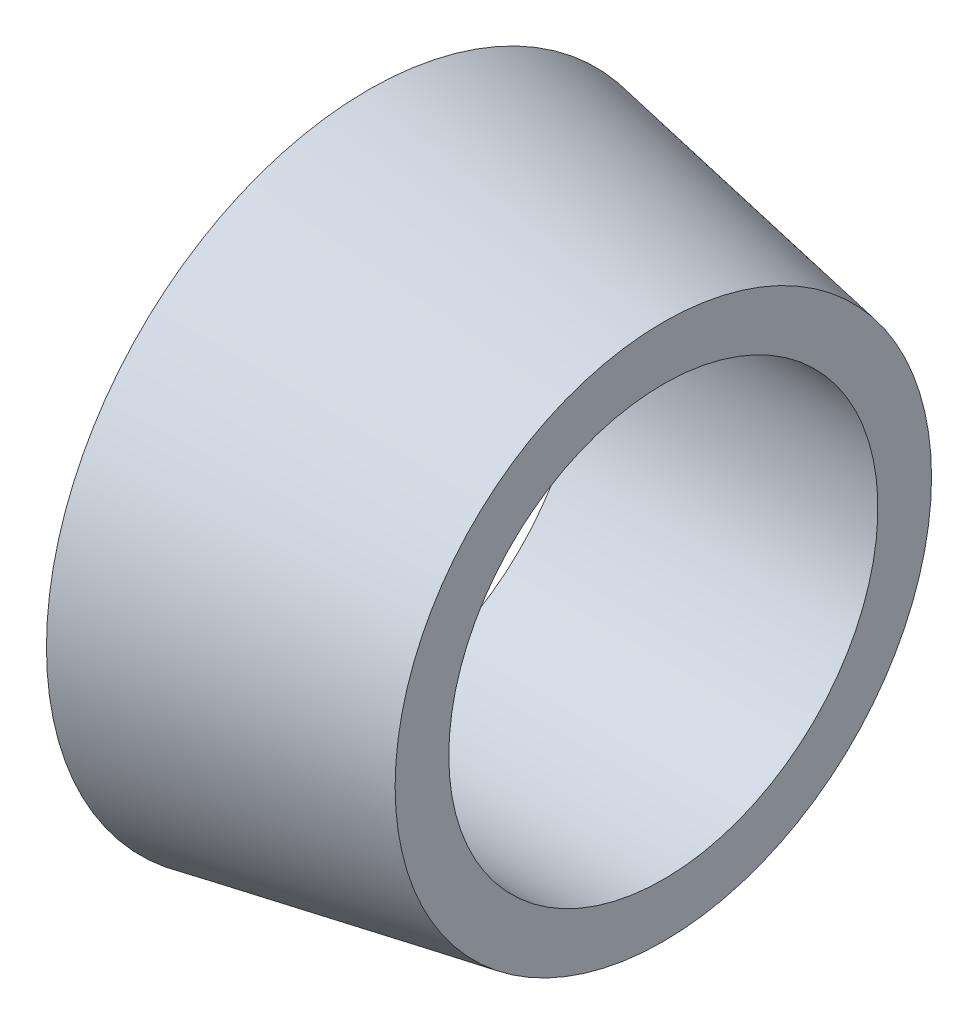
ISO-10303-21;
HEADER;
FILE_DESCRIPTION(('STEP AP214'),'2;1');
FILE_NAME('part.step','',(''),(''),'','','');
FILE_SCHEMA(('AUTOMOTIVE_DESIGN { 1 0 10303 214 1 1 1 1 }'));
ENDSEC;
DATA;
#1=APPLICATION_CONTEXT('core data for automotive mechanical design processes');
#2=APPLICATION_PROTOCOL_DEFINITION('international standard','automotive_design',2000,#1);
#3=PRODUCT_CONTEXT('',#1,'mechanical');
#4=PRODUCT('Part','Part','',(#3));
#5=PRODUCT_RELATED_PRODUCT_CATEGORY('part','',(#4));
#6=PRODUCT_DEFINITION_FORMATION('','',#4);
#7=PRODUCT_DEFINITION_CONTEXT('part definition',#1,'design');
#8=PRODUCT_DEFINITION('design','',#6,#7);
#9=PRODUCT_DEFINITION_SHAPE('','',#8);
#10=(LENGTH_UNIT() NAMED_UNIT(*) SI_UNIT(.MILLI.,.METRE.));
#11=(NAMED_UNIT(*) PLANE_ANGLE_UNIT() SI_UNIT($,.RADIAN.));
#12=(NAMED_UNIT(*) SI_UNIT($,.STERADIAN.) SOLID_ANGLE_UNIT());
#13=UNCERTAINTY_MEASURE_WITH_UNIT(LENGTH_MEASURE(1.E-05),#10,'distance_accuracy_value','');
#14=(GEOMETRIC_REPRESENTATION_CONTEXT(3) GLOBAL_UNCERTAINTY_ASSIGNED_CONTEXT((#13)) GLOBAL_UNIT_ASSIGNED_CONTEXT((#10,
#11,#12)) REPRESENTATION_CONTEXT('',''));
#15=CARTESIAN_POINT('',(0.,0.,0.));
#16=DIRECTION('',(0.,0.,1.));
#17=DIRECTION('',(1.,0.,0.));
#18=AXIS2_PLACEMENT_3D('',#15,#16,#17);
#19=CARTESIAN_POINT('',(0.,0.,0.));
#20=DIRECTION('',(-1.,0.,0.));
#21=DIRECTION('',(0.,0.,1.));
#22=AXIS2_PLACEMENT_3D('',#19,#20,#21);
#23=CYLINDRICAL_SURFACE('',#22,4.);
#24=CARTESIAN_POINT('',(5.5,0.,0.));
#25=DIRECTION('',(-1.,0.,0.));
#26=DIRECTION('',(0.,0.,1.));
#27=AXIS2_PLACEMENT_3D('',#24,#25,#26);
#28=CIRCLE('',#27,4.);
#29=CARTESIAN_POINT('',(5.5,0.,4.));
#30=VERTEX_POINT('',#29);
#31=EDGE_CURVE('E46',#30,#30,#28,.T.);
#32=ORIENTED_EDGE('',*,*,#31,.F.);
#33=EDGE_LOOP('',(#32));
#34=FACE_BOUND('',#33,.T.);
#35=CARTESIAN_POINT('',(0.,0.,0.));
#36=DIRECTION('',(-1.,0.,0.));
#37=DIRECTION('',(0.,0.,1.));
#38=AXIS2_PLACEMENT_3D('',#35,#36,#37);
#39=CIRCLE('',#38,4.);
#40=CARTESIAN_POINT('',(0.,0.,4.));
#41=VERTEX_POINT('',#40);
#42=EDGE_CURVE('E10',#41,#41,#39,.T.);
#43=ORIENTED_EDGE('',*,*,#42,.T.);
#44=EDGE_LOOP('',(#43));
#45=FACE_BOUND('',#44,.T.);
#46=ADVANCED_FACE('F32',(#34,#45),#23,.F.);
#47=CARTESIAN_POINT('',(0.,4.,0.));
#48=DIRECTION('',(1.,0.,0.));
#49=DIRECTION('',(0.,0.,-1.));
#50=AXIS2_PLACEMENT_3D('',#47,#48,#49);
#51=PLANE('',#50);
#52=ORIENTED_EDGE('',*,*,#42,.F.);
#53=EDGE_LOOP('',(#52));
#54=FACE_BOUND('',#53,.T.);
#55=CARTESIAN_POINT('',(0.,0.,0.));
#56=DIRECTION('',(-1.,0.,0.));
#57=DIRECTION('',(0.,0.,1.));
#58=AXIS2_PLACEMENT_3D('',#55,#56,#57);
#59=CIRCLE('',#58,6.);
#60=CARTESIAN_POINT('',(0.,0.,6.));
#61=VERTEX_POINT('',#60);
#62=EDGE_CURVE('E38',#61,#61,#59,.T.);
#63=ORIENTED_EDGE('',*,*,#62,.T.);
#64=EDGE_LOOP('',(#63));
#65=FACE_BOUND('',#64,.T.);
#66=ADVANCED_FACE('F55',(#54,#65),#51,.F.);
#67=CARTESIAN_POINT('',(5.5,0.,0.));
#68=DIRECTION('',(-1.,0.,0.));
#69=DIRECTION('',(0.,0.,1.));
#70=AXIS2_PLACEMENT_3D('',#67,#68,#69);
#71=CONICAL_SURFACE('',#70,5.,0.179853499792478);
#72=ORIENTED_EDGE('',*,*,#62,.F.);
#73=EDGE_LOOP('',(#72));
#74=FACE_BOUND('',#73,.T.);
#75=CARTESIAN_POINT('',(5.5,0.,0.));
#76=DIRECTION('',(-1.,0.,0.));
#77=DIRECTION('',(0.,0.,1.));
#78=AXIS2_PLACEMENT_3D('',#75,#76,#77);
#79=CIRCLE('',#78,5.);
#80=CARTESIAN_POINT('',(5.5,0.,5.));
#81=VERTEX_POINT('',#80);
#82=EDGE_CURVE('E42',#81,#81,#79,.T.);
#83=ORIENTED_EDGE('',*,*,#82,.T.);
#84=EDGE_LOOP('',(#83));
#85=FACE_BOUND('',#84,.T.);
#86=ADVANCED_FACE('F59',(#74,#85),#71,.T.);
#87=CARTESIAN_POINT('',(5.5,5.,0.));
#88=DIRECTION('',(-1.,0.,0.));
#89=DIRECTION('',(0.,0.,1.));
#90=AXIS2_PLACEMENT_3D('',#87,#88,#89);
#91=PLANE('',#90);
#92=ORIENTED_EDGE('',*,*,#82,.F.);
#93=EDGE_LOOP('',(#92));
#94=FACE_BOUND('',#93,.T.);
#95=ORIENTED_EDGE('',*,*,#31,.T.);
#96=EDGE_LOOP('',(#95));
#97=FACE_BOUND('',#96,.T.);
#98=ADVANCED_FACE('F52',(#94,#97),#91,.F.);
#99=CLOSED_SHELL('',(#46,#66,#86,#98));
#100=MANIFOLD_SOLID_BREP('B2',#99);
#101=ADVANCED_BREP_SHAPE_REPRESENTATION('',(#18,#100),#14);
#102=SHAPE_DEFINITION_REPRESENTATION(#9,#101);
ENDSEC;
END-ISO-10303-21;
